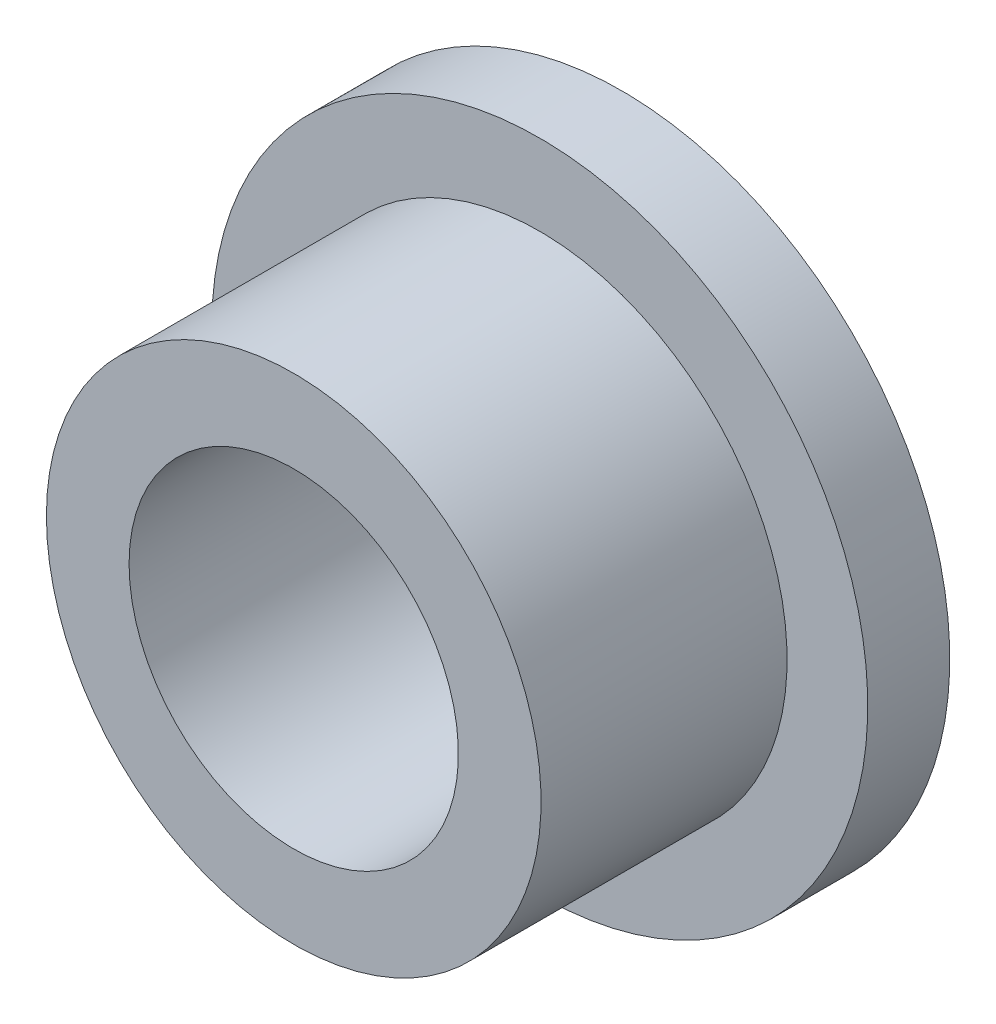
ISO-10303-21;
HEADER;
FILE_DESCRIPTION(('STEP AP214'),'2;1');
FILE_NAME('part.step','',(''),(''),'','','');
FILE_SCHEMA(('AUTOMOTIVE_DESIGN { 1 0 10303 214 1 1 1 1 }'));
ENDSEC;
DATA;
#1=APPLICATION_CONTEXT('core data for automotive mechanical design processes');
#2=APPLICATION_PROTOCOL_DEFINITION('international standard','automotive_design',2000,#1);
#3=PRODUCT_CONTEXT('',#1,'mechanical');
#4=PRODUCT('Part','Part','',(#3));
#5=PRODUCT_RELATED_PRODUCT_CATEGORY('part','',(#4));
#6=PRODUCT_DEFINITION_FORMATION('','',#4);
#7=PRODUCT_DEFINITION_CONTEXT('part definition',#1,'design');
#8=PRODUCT_DEFINITION('design','',#6,#7);
#9=PRODUCT_DEFINITION_SHAPE('','',#8);
#10=(LENGTH_UNIT() NAMED_UNIT(*) SI_UNIT(.MILLI.,.METRE.));
#11=(NAMED_UNIT(*) PLANE_ANGLE_UNIT() SI_UNIT($,.RADIAN.));
#12=(NAMED_UNIT(*) SI_UNIT($,.STERADIAN.) SOLID_ANGLE_UNIT());
#13=UNCERTAINTY_MEASURE_WITH_UNIT(LENGTH_MEASURE(1.E-05),#10,'distance_accuracy_value','');
#14=(GEOMETRIC_REPRESENTATION_CONTEXT(3) GLOBAL_UNCERTAINTY_ASSIGNED_CONTEXT((#13)) GLOBAL_UNIT_ASSIGNED_CONTEXT((#10,
#11,#12)) REPRESENTATION_CONTEXT('',''));
#15=CARTESIAN_POINT('',(0.,0.,0.));
#16=DIRECTION('',(0.,0.,1.));
#17=DIRECTION('',(1.,0.,0.));
#18=AXIS2_PLACEMENT_3D('',#15,#16,#17);
#19=CARTESIAN_POINT('',(4.7879,0.,6.35));
#20=DIRECTION('',(0.,0.,1.));
#21=DIRECTION('',(1.,0.,0.));
#22=AXIS2_PLACEMENT_3D('',#19,#20,#21);
#23=PLANE('',#22);
#24=CARTESIAN_POINT('',(0.,0.,6.35));
#25=DIRECTION('',(0.,0.,-1.));
#26=DIRECTION('',(-1.,0.,0.));
#27=AXIS2_PLACEMENT_3D('',#24,#25,#26);
#28=CIRCLE('',#27,3.1877);
#29=CARTESIAN_POINT('',(-3.1877,0.,6.35));
#30=VERTEX_POINT('',#29);
#31=EDGE_CURVE('E10',#30,#30,#28,.T.);
#32=ORIENTED_EDGE('',*,*,#31,.T.);
#33=EDGE_LOOP('',(#32));
#34=FACE_BOUND('',#33,.T.);
#35=CARTESIAN_POINT('',(0.,0.,6.35));
#36=DIRECTION('',(0.,0.,-1.));
#37=DIRECTION('',(-1.,0.,0.));
#38=AXIS2_PLACEMENT_3D('',#35,#36,#37);
#39=CIRCLE('',#38,4.7879);
#40=CARTESIAN_POINT('',(-4.7879,0.,6.35));
#41=VERTEX_POINT('',#40);
#42=EDGE_CURVE('E57',#41,#41,#39,.T.);
#43=ORIENTED_EDGE('',*,*,#42,.F.);
#44=EDGE_LOOP('',(#43));
#45=FACE_BOUND('',#44,.T.);
#46=ADVANCED_FACE('F35',(#34,#45),#23,.T.);
#47=CARTESIAN_POINT('',(0.,0.,6.35));
#48=DIRECTION('',(0.,0.,-1.));
#49=DIRECTION('',(-1.,0.,0.));
#50=AXIS2_PLACEMENT_3D('',#47,#48,#49);
#51=CYLINDRICAL_SURFACE('',#50,3.1877);
#52=CARTESIAN_POINT('',(0.,0.,0.));
#53=DIRECTION('',(0.,0.,-1.));
#54=DIRECTION('',(-1.,0.,0.));
#55=AXIS2_PLACEMENT_3D('',#52,#53,#54);
#56=CIRCLE('',#55,3.1877);
#57=CARTESIAN_POINT('',(-3.1877,0.,0.));
#58=VERTEX_POINT('',#57);
#59=EDGE_CURVE('E41',#58,#58,#56,.T.);
#60=ORIENTED_EDGE('',*,*,#59,.T.);
#61=EDGE_LOOP('',(#60));
#62=FACE_BOUND('',#61,.T.);
#63=ORIENTED_EDGE('',*,*,#31,.F.);
#64=EDGE_LOOP('',(#63));
#65=FACE_BOUND('',#64,.T.);
#66=ADVANCED_FACE('F65',(#62,#65),#51,.F.);
#67=CARTESIAN_POINT('',(3.1877,0.,0.));
#68=DIRECTION('',(0.,0.,-1.));
#69=DIRECTION('',(-1.,0.,0.));
#70=AXIS2_PLACEMENT_3D('',#67,#68,#69);
#71=PLANE('',#70);
#72=CARTESIAN_POINT('',(0.,0.,0.));
#73=DIRECTION('',(0.,0.,-1.));
#74=DIRECTION('',(-1.,0.,0.));
#75=AXIS2_PLACEMENT_3D('',#72,#73,#74);
#76=CIRCLE('',#75,6.35);
#77=CARTESIAN_POINT('',(-6.35,0.,0.));
#78=VERTEX_POINT('',#77);
#79=EDGE_CURVE('E45',#78,#78,#76,.T.);
#80=ORIENTED_EDGE('',*,*,#79,.T.);
#81=EDGE_LOOP('',(#80));
#82=FACE_BOUND('',#81,.T.);
#83=ORIENTED_EDGE('',*,*,#59,.F.);
#84=EDGE_LOOP('',(#83));
#85=FACE_BOUND('',#84,.T.);
#86=ADVANCED_FACE('F69',(#82,#85),#71,.T.);
#87=CARTESIAN_POINT('',(0.,0.,6.35));
#88=DIRECTION('',(0.,0.,-1.));
#89=DIRECTION('',(-1.,0.,0.));
#90=AXIS2_PLACEMENT_3D('',#87,#88,#89);
#91=CYLINDRICAL_SURFACE('',#90,6.35);
#92=CARTESIAN_POINT('',(0.,0.,1.5875));
#93=DIRECTION('',(0.,0.,-1.));
#94=DIRECTION('',(-1.,0.,0.));
#95=AXIS2_PLACEMENT_3D('',#92,#93,#94);
#96=CIRCLE('',#95,6.35);
#97=CARTESIAN_POINT('',(-6.35,0.,1.5875));
#98=VERTEX_POINT('',#97);
#99=EDGE_CURVE('E49',#98,#98,#96,.T.);
#100=ORIENTED_EDGE('',*,*,#99,.T.);
#101=EDGE_LOOP('',(#100));
#102=FACE_BOUND('',#101,.T.);
#103=ORIENTED_EDGE('',*,*,#79,.F.);
#104=EDGE_LOOP('',(#103));
#105=FACE_BOUND('',#104,.T.);
#106=ADVANCED_FACE('F73',(#102,#105),#91,.T.);
#107=CARTESIAN_POINT('',(6.35,0.,1.5875));
#108=DIRECTION('',(0.,0.,1.));
#109=DIRECTION('',(1.,0.,0.));
#110=AXIS2_PLACEMENT_3D('',#107,#108,#109);
#111=PLANE('',#110);
#112=CARTESIAN_POINT('',(0.,0.,1.5875));
#113=DIRECTION('',(0.,0.,-1.));
#114=DIRECTION('',(-1.,0.,0.));
#115=AXIS2_PLACEMENT_3D('',#112,#113,#114);
#116=CIRCLE('',#115,4.7879);
#117=CARTESIAN_POINT('',(-4.7879,0.,1.5875));
#118=VERTEX_POINT('',#117);
#119=EDGE_CURVE('E54',#118,#118,#116,.T.);
#120=ORIENTED_EDGE('',*,*,#119,.T.);
#121=EDGE_LOOP('',(#120));
#122=FACE_BOUND('',#121,.T.);
#123=ORIENTED_EDGE('',*,*,#99,.F.);
#124=EDGE_LOOP('',(#123));
#125=FACE_BOUND('',#124,.T.);
#126=ADVANCED_FACE('F80',(#122,#125),#111,.T.);
#127=CARTESIAN_POINT('',(0.,0.,6.35));
#128=DIRECTION('',(0.,0.,-1.));
#129=DIRECTION('',(-1.,0.,0.));
#130=AXIS2_PLACEMENT_3D('',#127,#128,#129);
#131=CYLINDRICAL_SURFACE('',#130,4.7879);
#132=ORIENTED_EDGE('',*,*,#42,.T.);
#133=EDGE_LOOP('',(#132));
#134=FACE_BOUND('',#133,.T.);
#135=ORIENTED_EDGE('',*,*,#119,.F.);
#136=EDGE_LOOP('',(#135));
#137=FACE_BOUND('',#136,.T.);
#138=ADVANCED_FACE('F61',(#134,#137),#131,.T.);
#139=CLOSED_SHELL('',(#46,#66,#86,#106,#126,#138));
#140=MANIFOLD_SOLID_BREP('B2',#139);
#141=ADVANCED_BREP_SHAPE_REPRESENTATION('',(#18,#140),#14);
#142=SHAPE_DEFINITION_REPRESENTATION(#9,#141);
ENDSEC;
END-ISO-10303-21;
